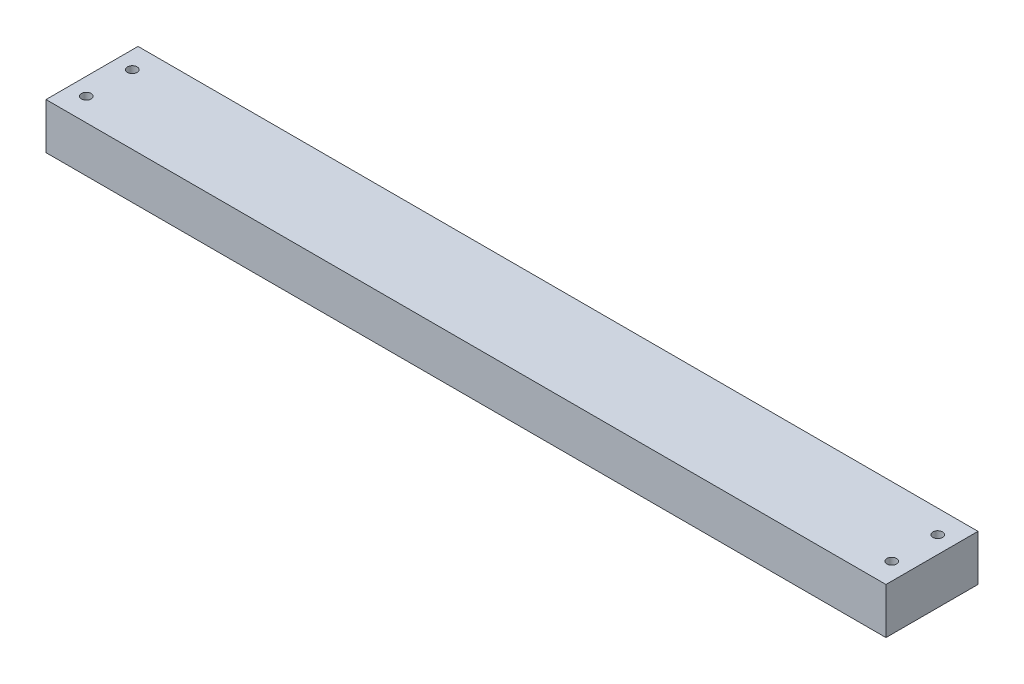
ISO-10303-21;
HEADER;
FILE_DESCRIPTION(('STEP AP214'),'2;1');
FILE_NAME('part.step','',(''),(''),'','','');
FILE_SCHEMA(('AUTOMOTIVE_DESIGN { 1 0 10303 214 1 1 1 1 }'));
ENDSEC;
DATA;
#1=APPLICATION_CONTEXT('core data for automotive mechanical design processes');
#2=APPLICATION_PROTOCOL_DEFINITION('international standard','automotive_design',2000,#1);
#3=PRODUCT_CONTEXT('',#1,'mechanical');
#4=PRODUCT('Part','Part','',(#3));
#5=PRODUCT_RELATED_PRODUCT_CATEGORY('part','',(#4));
#6=PRODUCT_DEFINITION_FORMATION('','',#4);
#7=PRODUCT_DEFINITION_CONTEXT('part definition',#1,'design');
#8=PRODUCT_DEFINITION('design','',#6,#7);
#9=PRODUCT_DEFINITION_SHAPE('','',#8);
#10=(LENGTH_UNIT() NAMED_UNIT(*) SI_UNIT(.MILLI.,.METRE.));
#11=(NAMED_UNIT(*) PLANE_ANGLE_UNIT() SI_UNIT($,.RADIAN.));
#12=(NAMED_UNIT(*) SI_UNIT($,.STERADIAN.) SOLID_ANGLE_UNIT());
#13=UNCERTAINTY_MEASURE_WITH_UNIT(LENGTH_MEASURE(1.E-05),#10,'distance_accuracy_value','');
#14=(GEOMETRIC_REPRESENTATION_CONTEXT(3) GLOBAL_UNCERTAINTY_ASSIGNED_CONTEXT((#13)) GLOBAL_UNIT_ASSIGNED_CONTEXT((#10,
#11,#12)) REPRESENTATION_CONTEXT('',''));
#15=CARTESIAN_POINT('',(0.,0.,0.));
#16=DIRECTION('',(0.,0.,1.));
#17=DIRECTION('',(1.,0.,0.));
#18=AXIS2_PLACEMENT_3D('',#15,#16,#17);
#19=CARTESIAN_POINT('',(463.55,-12.7,25.4));
#20=DIRECTION('',(0.,0.,1.));
#21=DIRECTION('',(1.,0.,0.));
#22=AXIS2_PLACEMENT_3D('',#19,#20,#21);
#23=PLANE('',#22);
#24=DIRECTION('',(0.,1.,0.));
#25=VECTOR('',#24,1.);
#26=CARTESIAN_POINT('',(0.,-12.7,25.4));
#27=LINE('',#26,#25);
#28=CARTESIAN_POINT('',(0.,-12.7,25.4));
#29=VERTEX_POINT('',#28);
#30=CARTESIAN_POINT('',(0.,12.7,25.4));
#31=VERTEX_POINT('',#30);
#32=EDGE_CURVE('E111',#29,#31,#27,.T.);
#33=ORIENTED_EDGE('',*,*,#32,.F.);
#34=DIRECTION('',(-1.,0.,0.));
#35=VECTOR('',#34,1.);
#36=CARTESIAN_POINT('',(463.55,-12.7,25.4));
#37=LINE('',#36,#35);
#38=CARTESIAN_POINT('',(463.55,-12.7,25.4));
#39=VERTEX_POINT('',#38);
#40=EDGE_CURVE('E11',#39,#29,#37,.T.);
#41=ORIENTED_EDGE('',*,*,#40,.F.);
#42=DIRECTION('',(0.,1.,0.));
#43=VECTOR('',#42,1.);
#44=CARTESIAN_POINT('',(463.55,-12.7,25.4));
#45=LINE('',#44,#43);
#46=CARTESIAN_POINT('',(463.55,12.7,25.4));
#47=VERTEX_POINT('',#46);
#48=EDGE_CURVE('E103',#39,#47,#45,.T.);
#49=ORIENTED_EDGE('',*,*,#48,.T.);
#50=DIRECTION('',(-1.,0.,0.));
#51=VECTOR('',#50,1.);
#52=CARTESIAN_POINT('',(463.55,12.7,25.4));
#53=LINE('',#52,#51);
#54=EDGE_CURVE('E42',#47,#31,#53,.T.);
#55=ORIENTED_EDGE('',*,*,#54,.T.);
#56=EDGE_LOOP('',(#33,#41,#49,#55));
#57=FACE_BOUND('',#56,.T.);
#58=ADVANCED_FACE('F39',(#57),#23,.T.);
#59=CARTESIAN_POINT('',(463.55,-12.7,25.4));
#60=DIRECTION('',(0.,1.,0.));
#61=DIRECTION('',(0.,0.,1.));
#62=AXIS2_PLACEMENT_3D('',#59,#60,#61);
#63=PLANE('',#62);
#64=CARTESIAN_POINT('',(454.025,-12.7,-12.7000000000001));
#65=DIRECTION('',(0.,1.,0.));
#66=DIRECTION('',(0.,0.,1.));
#67=AXIS2_PLACEMENT_3D('',#64,#65,#66);
#68=CIRCLE('',#67,2.66699999999997);
#69=CARTESIAN_POINT('',(454.025,-12.7,-10.0330000000001));
#70=VERTEX_POINT('',#69);
#71=EDGE_CURVE('E172',#70,#70,#68,.F.);
#72=ORIENTED_EDGE('',*,*,#71,.F.);
#73=EDGE_LOOP('',(#72));
#74=FACE_BOUND('',#73,.T.);
#75=CARTESIAN_POINT('',(454.025,-12.7,12.6999999999999));
#76=DIRECTION('',(0.,1.,0.));
#77=DIRECTION('',(0.,0.,1.));
#78=AXIS2_PLACEMENT_3D('',#75,#76,#77);
#79=CIRCLE('',#78,2.66699999999997);
#80=CARTESIAN_POINT('',(454.025,-12.7,15.3669999999999));
#81=VERTEX_POINT('',#80);
#82=EDGE_CURVE('E178',#81,#81,#79,.F.);
#83=ORIENTED_EDGE('',*,*,#82,.F.);
#84=EDGE_LOOP('',(#83));
#85=FACE_BOUND('',#84,.T.);
#86=CARTESIAN_POINT('',(9.52499999999998,-12.7,12.7));
#87=DIRECTION('',(0.,1.,0.));
#88=DIRECTION('',(0.,0.,1.));
#89=AXIS2_PLACEMENT_3D('',#86,#87,#88);
#90=CIRCLE('',#89,2.667);
#91=CARTESIAN_POINT('',(9.52499999999998,-12.7,15.367));
#92=VERTEX_POINT('',#91);
#93=EDGE_CURVE('E164',#92,#92,#90,.F.);
#94=ORIENTED_EDGE('',*,*,#93,.F.);
#95=EDGE_LOOP('',(#94));
#96=FACE_BOUND('',#95,.T.);
#97=CARTESIAN_POINT('',(9.52499999999995,-12.7,-12.7));
#98=DIRECTION('',(0.,1.,0.));
#99=DIRECTION('',(0.,0.,1.));
#100=AXIS2_PLACEMENT_3D('',#97,#98,#99);
#101=CIRCLE('',#100,2.667);
#102=CARTESIAN_POINT('',(9.52499999999995,-12.7,-10.033));
#103=VERTEX_POINT('',#102);
#104=EDGE_CURVE('E116',#103,#103,#101,.F.);
#105=ORIENTED_EDGE('',*,*,#104,.F.);
#106=EDGE_LOOP('',(#105));
#107=FACE_BOUND('',#106,.T.);
#108=DIRECTION('',(0.,0.,-1.));
#109=VECTOR('',#108,1.);
#110=CARTESIAN_POINT('',(0.,-12.7,25.4));
#111=LINE('',#110,#109);
#112=CARTESIAN_POINT('',(0.,-12.7,-25.4));
#113=VERTEX_POINT('',#112);
#114=EDGE_CURVE('E73',#29,#113,#111,.T.);
#115=ORIENTED_EDGE('',*,*,#114,.T.);
#116=DIRECTION('',(-1.,0.,0.));
#117=VECTOR('',#116,1.);
#118=CARTESIAN_POINT('',(463.55,-12.7,-25.4));
#119=LINE('',#118,#117);
#120=CARTESIAN_POINT('',(463.55,-12.7,-25.4));
#121=VERTEX_POINT('',#120);
#122=EDGE_CURVE('E49',#121,#113,#119,.T.);
#123=ORIENTED_EDGE('',*,*,#122,.F.);
#124=DIRECTION('',(0.,0.,-1.));
#125=VECTOR('',#124,1.);
#126=CARTESIAN_POINT('',(463.55,-12.7,25.4));
#127=LINE('',#126,#125);
#128=EDGE_CURVE('E90',#39,#121,#127,.T.);
#129=ORIENTED_EDGE('',*,*,#128,.F.);
#130=ORIENTED_EDGE('',*,*,#40,.T.);
#131=EDGE_LOOP('',(#115,#123,#129,#130));
#132=FACE_BOUND('',#131,.T.);
#133=ADVANCED_FACE('F128',(#74,#85,#96,#107,#132),#63,.F.);
#134=CARTESIAN_POINT('',(463.55,-12.7,-25.4));
#135=DIRECTION('',(0.,0.,1.));
#136=DIRECTION('',(1.,0.,0.));
#137=AXIS2_PLACEMENT_3D('',#134,#135,#136);
#138=PLANE('',#137);
#139=DIRECTION('',(0.,1.,0.));
#140=VECTOR('',#139,1.);
#141=CARTESIAN_POINT('',(0.,-12.7,-25.4));
#142=LINE('',#141,#140);
#143=CARTESIAN_POINT('',(0.,12.7,-25.4));
#144=VERTEX_POINT('',#143);
#145=EDGE_CURVE('E98',#113,#144,#142,.T.);
#146=ORIENTED_EDGE('',*,*,#145,.T.);
#147=DIRECTION('',(-1.,0.,0.));
#148=VECTOR('',#147,1.);
#149=CARTESIAN_POINT('',(463.55,12.7,-25.4));
#150=LINE('',#149,#148);
#151=CARTESIAN_POINT('',(463.55,12.7,-25.4));
#152=VERTEX_POINT('',#151);
#153=EDGE_CURVE('E95',#152,#144,#150,.T.);
#154=ORIENTED_EDGE('',*,*,#153,.F.);
#155=DIRECTION('',(0.,1.,0.));
#156=VECTOR('',#155,1.);
#157=CARTESIAN_POINT('',(463.55,-12.7,-25.4));
#158=LINE('',#157,#156);
#159=EDGE_CURVE('E85',#121,#152,#158,.T.);
#160=ORIENTED_EDGE('',*,*,#159,.F.);
#161=ORIENTED_EDGE('',*,*,#122,.T.);
#162=EDGE_LOOP('',(#146,#154,#160,#161));
#163=FACE_BOUND('',#162,.T.);
#164=ADVANCED_FACE('F96',(#163),#138,.F.);
#165=CARTESIAN_POINT('',(463.55,12.7,25.4));
#166=DIRECTION('',(0.,1.,0.));
#167=DIRECTION('',(0.,0.,1.));
#168=AXIS2_PLACEMENT_3D('',#165,#166,#167);
#169=PLANE('',#168);
#170=CARTESIAN_POINT('',(454.025,12.7,-12.7000000000001));
#171=DIRECTION('',(0.,1.,0.));
#172=DIRECTION('',(0.,0.,1.));
#173=AXIS2_PLACEMENT_3D('',#170,#171,#172);
#174=CIRCLE('',#173,2.66699999999997);
#175=CARTESIAN_POINT('',(454.025,12.7,-10.0330000000001));
#176=VERTEX_POINT('',#175);
#177=EDGE_CURVE('E150',#176,#176,#174,.T.);
#178=ORIENTED_EDGE('',*,*,#177,.F.);
#179=EDGE_LOOP('',(#178));
#180=FACE_BOUND('',#179,.T.);
#181=CARTESIAN_POINT('',(454.025,12.7,12.6999999999999));
#182=DIRECTION('',(0.,1.,0.));
#183=DIRECTION('',(0.,0.,1.));
#184=AXIS2_PLACEMENT_3D('',#181,#182,#183);
#185=CIRCLE('',#184,2.66699999999997);
#186=CARTESIAN_POINT('',(454.025,12.7,15.3669999999999));
#187=VERTEX_POINT('',#186);
#188=EDGE_CURVE('E154',#187,#187,#185,.T.);
#189=ORIENTED_EDGE('',*,*,#188,.F.);
#190=EDGE_LOOP('',(#189));
#191=FACE_BOUND('',#190,.T.);
#192=CARTESIAN_POINT('',(9.52499999999998,12.7,12.7));
#193=DIRECTION('',(0.,1.,0.));
#194=DIRECTION('',(0.,0.,1.));
#195=AXIS2_PLACEMENT_3D('',#192,#193,#194);
#196=CIRCLE('',#195,2.667);
#197=CARTESIAN_POINT('',(9.52499999999998,12.7,15.367));
#198=VERTEX_POINT('',#197);
#199=EDGE_CURVE('E158',#198,#198,#196,.T.);
#200=ORIENTED_EDGE('',*,*,#199,.F.);
#201=EDGE_LOOP('',(#200));
#202=FACE_BOUND('',#201,.T.);
#203=CARTESIAN_POINT('',(9.52499999999995,12.7,-12.7));
#204=DIRECTION('',(0.,1.,0.));
#205=DIRECTION('',(0.,0.,1.));
#206=AXIS2_PLACEMENT_3D('',#203,#204,#205);
#207=CIRCLE('',#206,2.667);
#208=CARTESIAN_POINT('',(9.52499999999995,12.7,-10.033));
#209=VERTEX_POINT('',#208);
#210=EDGE_CURVE('E161',#209,#209,#207,.T.);
#211=ORIENTED_EDGE('',*,*,#210,.F.);
#212=EDGE_LOOP('',(#211));
#213=FACE_BOUND('',#212,.T.);
#214=DIRECTION('',(0.,0.,-1.));
#215=VECTOR('',#214,1.);
#216=CARTESIAN_POINT('',(0.,12.7,25.4));
#217=LINE('',#216,#215);
#218=EDGE_CURVE('E115',#31,#144,#217,.T.);
#219=ORIENTED_EDGE('',*,*,#218,.F.);
#220=ORIENTED_EDGE('',*,*,#54,.F.);
#221=DIRECTION('',(0.,0.,-1.));
#222=VECTOR('',#221,1.);
#223=CARTESIAN_POINT('',(463.55,12.7,25.4));
#224=LINE('',#223,#222);
#225=EDGE_CURVE('E89',#47,#152,#224,.T.);
#226=ORIENTED_EDGE('',*,*,#225,.T.);
#227=ORIENTED_EDGE('',*,*,#153,.T.);
#228=EDGE_LOOP('',(#219,#220,#226,#227));
#229=FACE_BOUND('',#228,.T.);
#230=ADVANCED_FACE('F101',(#180,#191,#202,#213,#229),#169,.T.);
#231=CARTESIAN_POINT('',(463.55,0.,0.));
#232=DIRECTION('',(-1.,0.,0.));
#233=DIRECTION('',(0.,0.,1.));
#234=AXIS2_PLACEMENT_3D('',#231,#232,#233);
#235=PLANE('',#234);
#236=ORIENTED_EDGE('',*,*,#48,.F.);
#237=ORIENTED_EDGE('',*,*,#128,.T.);
#238=ORIENTED_EDGE('',*,*,#159,.T.);
#239=ORIENTED_EDGE('',*,*,#225,.F.);
#240=EDGE_LOOP('',(#236,#237,#238,#239));
#241=FACE_BOUND('',#240,.T.);
#242=ADVANCED_FACE('F88',(#241),#235,.F.);
#243=CARTESIAN_POINT('',(0.,0.,0.));
#244=DIRECTION('',(-1.,0.,0.));
#245=DIRECTION('',(0.,0.,1.));
#246=AXIS2_PLACEMENT_3D('',#243,#244,#245);
#247=PLANE('',#246);
#248=ORIENTED_EDGE('',*,*,#32,.T.);
#249=ORIENTED_EDGE('',*,*,#218,.T.);
#250=ORIENTED_EDGE('',*,*,#145,.F.);
#251=ORIENTED_EDGE('',*,*,#114,.F.);
#252=EDGE_LOOP('',(#248,#249,#250,#251));
#253=FACE_BOUND('',#252,.T.);
#254=ADVANCED_FACE('F125',(#253),#247,.T.);
#255=CARTESIAN_POINT('',(9.52499999999995,-12.701,-12.7));
#256=DIRECTION('',(0.,1.,0.));
#257=DIRECTION('',(0.,0.,1.));
#258=AXIS2_PLACEMENT_3D('',#255,#256,#257);
#259=CYLINDRICAL_SURFACE('',#258,2.667);
#260=ORIENTED_EDGE('',*,*,#210,.T.);
#261=EDGE_LOOP('',(#260));
#262=FACE_BOUND('',#261,.T.);
#263=ORIENTED_EDGE('',*,*,#104,.T.);
#264=EDGE_LOOP('',(#263));
#265=FACE_BOUND('',#264,.T.);
#266=ADVANCED_FACE('F190',(#262,#265),#259,.F.);
#267=CARTESIAN_POINT('',(9.52499999999998,-12.701,12.7));
#268=DIRECTION('',(0.,1.,0.));
#269=DIRECTION('',(0.,0.,1.));
#270=AXIS2_PLACEMENT_3D('',#267,#268,#269);
#271=CYLINDRICAL_SURFACE('',#270,2.667);
#272=ORIENTED_EDGE('',*,*,#199,.T.);
#273=EDGE_LOOP('',(#272));
#274=FACE_BOUND('',#273,.T.);
#275=ORIENTED_EDGE('',*,*,#93,.T.);
#276=EDGE_LOOP('',(#275));
#277=FACE_BOUND('',#276,.T.);
#278=ADVANCED_FACE('F186',(#274,#277),#271,.F.);
#279=CARTESIAN_POINT('',(454.025,-12.701,12.6999999999999));
#280=DIRECTION('',(0.,1.,0.));
#281=DIRECTION('',(0.,0.,1.));
#282=AXIS2_PLACEMENT_3D('',#279,#280,#281);
#283=CYLINDRICAL_SURFACE('',#282,2.66699999999997);
#284=ORIENTED_EDGE('',*,*,#188,.T.);
#285=EDGE_LOOP('',(#284));
#286=FACE_BOUND('',#285,.T.);
#287=ORIENTED_EDGE('',*,*,#82,.T.);
#288=EDGE_LOOP('',(#287));
#289=FACE_BOUND('',#288,.T.);
#290=ADVANCED_FACE('F189',(#286,#289),#283,.F.);
#291=CARTESIAN_POINT('',(454.025,-12.701,-12.7000000000001));
#292=DIRECTION('',(0.,1.,0.));
#293=DIRECTION('',(0.,0.,1.));
#294=AXIS2_PLACEMENT_3D('',#291,#292,#293);
#295=CYLINDRICAL_SURFACE('',#294,2.66699999999997);
#296=ORIENTED_EDGE('',*,*,#177,.T.);
#297=EDGE_LOOP('',(#296));
#298=FACE_BOUND('',#297,.T.);
#299=ORIENTED_EDGE('',*,*,#71,.T.);
#300=EDGE_LOOP('',(#299));
#301=FACE_BOUND('',#300,.T.);
#302=ADVANCED_FACE('F203',(#298,#301),#295,.F.);
#303=CLOSED_SHELL('',(#58,#133,#164,#230,#242,#254,#266,#278,#290,#302));
#304=MANIFOLD_SOLID_BREP('B2',#303);
#305=ADVANCED_BREP_SHAPE_REPRESENTATION('',(#18,#304),#14);
#306=SHAPE_DEFINITION_REPRESENTATION(#9,#305);
ENDSEC;
END-ISO-10303-21;
